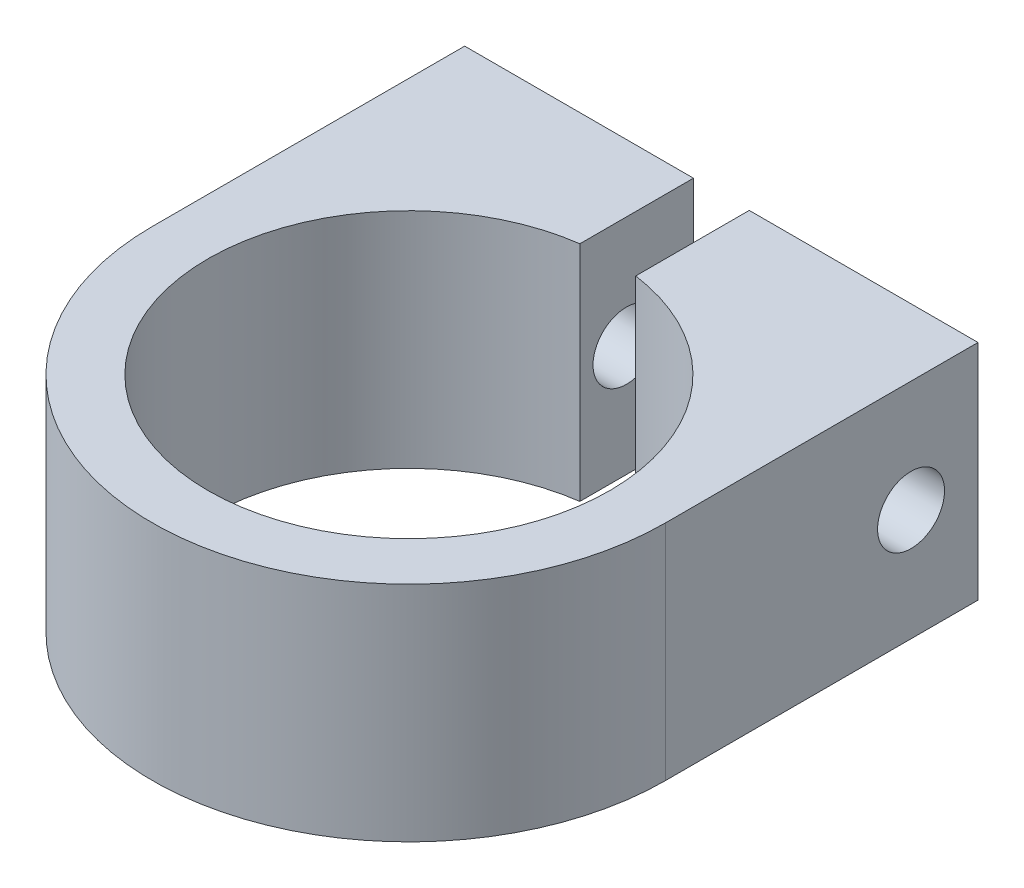
ISO-10303-21;
HEADER;
FILE_DESCRIPTION(('STEP AP214'),'2;1');
FILE_NAME('part.step','',(''),(''),'','','');
FILE_SCHEMA(('AUTOMOTIVE_DESIGN { 1 0 10303 214 1 1 1 1 }'));
ENDSEC;
DATA;
#1=APPLICATION_CONTEXT('core data for automotive mechanical design processes');
#2=APPLICATION_PROTOCOL_DEFINITION('international standard','automotive_design',2000,#1);
#3=PRODUCT_CONTEXT('',#1,'mechanical');
#4=PRODUCT('Part','Part','',(#3));
#5=PRODUCT_RELATED_PRODUCT_CATEGORY('part','',(#4));
#6=PRODUCT_DEFINITION_FORMATION('','',#4);
#7=PRODUCT_DEFINITION_CONTEXT('part definition',#1,'design');
#8=PRODUCT_DEFINITION('design','',#6,#7);
#9=PRODUCT_DEFINITION_SHAPE('','',#8);
#10=(LENGTH_UNIT() NAMED_UNIT(*) SI_UNIT(.MILLI.,.METRE.));
#11=(NAMED_UNIT(*) PLANE_ANGLE_UNIT() SI_UNIT($,.RADIAN.));
#12=(NAMED_UNIT(*) SI_UNIT($,.STERADIAN.) SOLID_ANGLE_UNIT());
#13=UNCERTAINTY_MEASURE_WITH_UNIT(LENGTH_MEASURE(1.E-05),#10,'distance_accuracy_value','');
#14=(GEOMETRIC_REPRESENTATION_CONTEXT(3) GLOBAL_UNCERTAINTY_ASSIGNED_CONTEXT((#13)) GLOBAL_UNIT_ASSIGNED_CONTEXT((#10,
#11,#12)) REPRESENTATION_CONTEXT('',''));
#15=CARTESIAN_POINT('',(0.,0.,0.));
#16=DIRECTION('',(0.,0.,1.));
#17=DIRECTION('',(1.,0.,0.));
#18=AXIS2_PLACEMENT_3D('',#15,#16,#17);
#19=CARTESIAN_POINT('',(-23.,9.99999999999993,-22.));
#20=DIRECTION('',(1.,0.,0.));
#21=DIRECTION('',(0.,0.,-1.));
#22=AXIS2_PLACEMENT_3D('',#19,#20,#21);
#23=CYLINDRICAL_SURFACE('',#22,3.);
#24=CARTESIAN_POINT('',(-2.5,9.99999999999993,-22.));
#25=DIRECTION('',(-1.,0.,0.));
#26=DIRECTION('',(0.,0.,1.));
#27=AXIS2_PLACEMENT_3D('',#24,#25,#26);
#28=CIRCLE('',#27,3.);
#29=CARTESIAN_POINT('',(-2.5,9.99999999999993,-19.));
#30=VERTEX_POINT('',#29);
#31=EDGE_CURVE('E195',#30,#30,#28,.T.);
#32=ORIENTED_EDGE('',*,*,#31,.F.);
#33=EDGE_LOOP('',(#32));
#34=FACE_BOUND('',#33,.T.);
#35=CARTESIAN_POINT('',(-13.,9.99999999999993,-22.));
#36=DIRECTION('',(-1.,0.,0.));
#37=DIRECTION('',(0.,0.,1.));
#38=AXIS2_PLACEMENT_3D('',#35,#36,#37);
#39=CIRCLE('',#38,3.);
#40=CARTESIAN_POINT('',(-13.,9.99999999999993,-19.));
#41=VERTEX_POINT('',#40);
#42=EDGE_CURVE('E37',#41,#41,#39,.F.);
#43=ORIENTED_EDGE('',*,*,#42,.F.);
#44=EDGE_LOOP('',(#43));
#45=FACE_BOUND('',#44,.T.);
#46=ADVANCED_FACE('F33',(#34,#45),#23,.F.);
#47=CARTESIAN_POINT('',(0.,20.,0.));
#48=DIRECTION('',(0.,-1.,0.));
#49=DIRECTION('',(0.,0.,-1.));
#50=AXIS2_PLACEMENT_3D('',#47,#48,#49);
#51=CYLINDRICAL_SURFACE('',#50,23.);
#52=CARTESIAN_POINT('',(0.,0.,0.));
#53=DIRECTION('',(0.,1.,0.));
#54=DIRECTION('',(0.,0.,1.));
#55=AXIS2_PLACEMENT_3D('',#52,#53,#54);
#56=CIRCLE('',#55,23.);
#57=CARTESIAN_POINT('',(-23.,0.,0.));
#58=VERTEX_POINT('',#57);
#59=CARTESIAN_POINT('',(23.,0.,0.));
#60=VERTEX_POINT('',#59);
#61=EDGE_CURVE('E143',#58,#60,#56,.T.);
#62=ORIENTED_EDGE('',*,*,#61,.T.);
#63=DIRECTION('',(0.,-1.,0.));
#64=VECTOR('',#63,1.);
#65=CARTESIAN_POINT('',(23.,20.,0.));
#66=LINE('',#65,#64);
#67=CARTESIAN_POINT('',(23.,20.,0.));
#68=VERTEX_POINT('',#67);
#69=EDGE_CURVE('E11',#68,#60,#66,.T.);
#70=ORIENTED_EDGE('',*,*,#69,.F.);
#71=CARTESIAN_POINT('',(0.,20.,0.));
#72=DIRECTION('',(0.,1.,0.));
#73=DIRECTION('',(0.,0.,1.));
#74=AXIS2_PLACEMENT_3D('',#71,#72,#73);
#75=CIRCLE('',#74,23.);
#76=CARTESIAN_POINT('',(-23.,20.,0.));
#77=VERTEX_POINT('',#76);
#78=EDGE_CURVE('E159',#77,#68,#75,.T.);
#79=ORIENTED_EDGE('',*,*,#78,.F.);
#80=DIRECTION('',(0.,-1.,0.));
#81=VECTOR('',#80,1.);
#82=CARTESIAN_POINT('',(-23.,20.,0.));
#83=LINE('',#82,#81);
#84=EDGE_CURVE('E139',#77,#58,#83,.T.);
#85=ORIENTED_EDGE('',*,*,#84,.T.);
#86=EDGE_LOOP('',(#62,#70,#79,#85));
#87=FACE_BOUND('',#86,.T.);
#88=ADVANCED_FACE('F35',(#87),#51,.T.);
#89=CARTESIAN_POINT('',(23.,20.,0.));
#90=DIRECTION('',(-1.,0.,0.));
#91=DIRECTION('',(0.,0.,1.));
#92=AXIS2_PLACEMENT_3D('',#89,#90,#91);
#93=PLANE('',#92);
#94=CARTESIAN_POINT('',(23.,9.99999999999993,-22.));
#95=DIRECTION('',(1.,0.,0.));
#96=DIRECTION('',(0.,0.,-1.));
#97=AXIS2_PLACEMENT_3D('',#94,#95,#96);
#98=CIRCLE('',#97,3.);
#99=CARTESIAN_POINT('',(23.,9.99999999999993,-25.));
#100=VERTEX_POINT('',#99);
#101=EDGE_CURVE('E198',#100,#100,#98,.T.);
#102=ORIENTED_EDGE('',*,*,#101,.F.);
#103=EDGE_LOOP('',(#102));
#104=FACE_BOUND('',#103,.T.);
#105=DIRECTION('',(0.,0.,-1.));
#106=VECTOR('',#105,1.);
#107=CARTESIAN_POINT('',(23.,0.,0.));
#108=LINE('',#107,#106);
#109=CARTESIAN_POINT('',(23.,0.,-28.));
#110=VERTEX_POINT('',#109);
#111=EDGE_CURVE('E146',#60,#110,#108,.T.);
#112=ORIENTED_EDGE('',*,*,#111,.T.);
#113=DIRECTION('',(0.,-1.,0.));
#114=VECTOR('',#113,1.);
#115=CARTESIAN_POINT('',(23.,20.,-28.));
#116=LINE('',#115,#114);
#117=CARTESIAN_POINT('',(23.,20.,-28.));
#118=VERTEX_POINT('',#117);
#119=EDGE_CURVE('E42',#118,#110,#116,.T.);
#120=ORIENTED_EDGE('',*,*,#119,.F.);
#121=DIRECTION('',(0.,0.,-1.));
#122=VECTOR('',#121,1.);
#123=CARTESIAN_POINT('',(23.,20.,0.));
#124=LINE('',#123,#122);
#125=EDGE_CURVE('E99',#68,#118,#124,.T.);
#126=ORIENTED_EDGE('',*,*,#125,.F.);
#127=ORIENTED_EDGE('',*,*,#69,.T.);
#128=EDGE_LOOP('',(#112,#120,#126,#127));
#129=FACE_BOUND('',#128,.T.);
#130=ADVANCED_FACE('F315',(#104,#129),#93,.F.);
#131=CARTESIAN_POINT('',(23.,20.,-28.));
#132=DIRECTION('',(0.,0.,1.));
#133=DIRECTION('',(1.,0.,0.));
#134=AXIS2_PLACEMENT_3D('',#131,#132,#133);
#135=PLANE('',#134);
#136=DIRECTION('',(-1.,0.,0.));
#137=VECTOR('',#136,1.);
#138=CARTESIAN_POINT('',(23.,0.,-28.));
#139=LINE('',#138,#137);
#140=CARTESIAN_POINT('',(2.5,0.,-28.));
#141=VERTEX_POINT('',#140);
#142=EDGE_CURVE('E149',#110,#141,#139,.T.);
#143=ORIENTED_EDGE('',*,*,#142,.T.);
#144=DIRECTION('',(0.,-1.,0.));
#145=VECTOR('',#144,1.);
#146=CARTESIAN_POINT('',(2.5,20.,-28.));
#147=LINE('',#146,#145);
#148=CARTESIAN_POINT('',(2.5,20.,-28.));
#149=VERTEX_POINT('',#148);
#150=EDGE_CURVE('E166',#149,#141,#147,.T.);
#151=ORIENTED_EDGE('',*,*,#150,.F.);
#152=DIRECTION('',(-1.,0.,0.));
#153=VECTOR('',#152,1.);
#154=CARTESIAN_POINT('',(23.,20.,-28.));
#155=LINE('',#154,#153);
#156=EDGE_CURVE('E175',#118,#149,#155,.T.);
#157=ORIENTED_EDGE('',*,*,#156,.F.);
#158=ORIENTED_EDGE('',*,*,#119,.T.);
#159=EDGE_LOOP('',(#143,#151,#157,#158));
#160=FACE_BOUND('',#159,.T.);
#161=ADVANCED_FACE('F173',(#160),#135,.F.);
#162=CARTESIAN_POINT('',(2.5,20.,-28.));
#163=DIRECTION('',(1.,0.,0.));
#164=DIRECTION('',(0.,0.,-1.));
#165=AXIS2_PLACEMENT_3D('',#162,#163,#164);
#166=PLANE('',#165);
#167=CARTESIAN_POINT('',(2.5,9.99999999999993,-22.));
#168=DIRECTION('',(1.,0.,0.));
#169=DIRECTION('',(0.,0.,-1.));
#170=AXIS2_PLACEMENT_3D('',#167,#168,#169);
#171=CIRCLE('',#170,3.);
#172=CARTESIAN_POINT('',(2.5,9.99999999999993,-25.));
#173=VERTEX_POINT('',#172);
#174=EDGE_CURVE('E147',#173,#173,#171,.T.);
#175=ORIENTED_EDGE('',*,*,#174,.T.);
#176=EDGE_LOOP('',(#175));
#177=FACE_BOUND('',#176,.T.);
#178=DIRECTION('',(0.,0.,1.));
#179=VECTOR('',#178,1.);
#180=CARTESIAN_POINT('',(2.5,0.,-28.));
#181=LINE('',#180,#179);
#182=CARTESIAN_POINT('',(2.50000000000001,0.,-17.8255434699759));
#183=VERTEX_POINT('',#182);
#184=EDGE_CURVE('E151',#141,#183,#181,.T.);
#185=ORIENTED_EDGE('',*,*,#184,.T.);
#186=DIRECTION('',(0.,-1.,0.));
#187=VECTOR('',#186,1.);
#188=CARTESIAN_POINT('',(2.50000000000001,20.,-17.8255434699759));
#189=LINE('',#188,#187);
#190=CARTESIAN_POINT('',(2.50000000000001,20.,-17.8255434699759));
#191=VERTEX_POINT('',#190);
#192=EDGE_CURVE('E163',#191,#183,#189,.T.);
#193=ORIENTED_EDGE('',*,*,#192,.F.);
#194=DIRECTION('',(0.,0.,1.));
#195=VECTOR('',#194,1.);
#196=CARTESIAN_POINT('',(2.5,20.,-28.));
#197=LINE('',#196,#195);
#198=EDGE_CURVE('E187',#149,#191,#197,.T.);
#199=ORIENTED_EDGE('',*,*,#198,.F.);
#200=ORIENTED_EDGE('',*,*,#150,.T.);
#201=EDGE_LOOP('',(#185,#193,#199,#200));
#202=FACE_BOUND('',#201,.T.);
#203=ADVANCED_FACE('F183',(#177,#202),#166,.F.);
#204=CARTESIAN_POINT('',(0.,20.,0.));
#205=DIRECTION('',(0.,-1.,0.));
#206=DIRECTION('',(0.,0.,-1.));
#207=AXIS2_PLACEMENT_3D('',#204,#205,#206);
#208=CYLINDRICAL_SURFACE('',#207,18.);
#209=CARTESIAN_POINT('',(0.,0.,0.));
#210=DIRECTION('',(0.,-1.,0.));
#211=DIRECTION('',(0.,0.,1.));
#212=AXIS2_PLACEMENT_3D('',#209,#210,#211);
#213=CIRCLE('',#212,18.);
#214=CARTESIAN_POINT('',(-2.5,0.,-17.8255434699759));
#215=VERTEX_POINT('',#214);
#216=EDGE_CURVE('E153',#183,#215,#213,.T.);
#217=ORIENTED_EDGE('',*,*,#216,.T.);
#218=DIRECTION('',(0.,-1.,0.));
#219=VECTOR('',#218,1.);
#220=CARTESIAN_POINT('',(-2.5,20.,-17.8255434699759));
#221=LINE('',#220,#219);
#222=CARTESIAN_POINT('',(-2.5,20.,-17.8255434699759));
#223=VERTEX_POINT('',#222);
#224=EDGE_CURVE('E134',#223,#215,#221,.T.);
#225=ORIENTED_EDGE('',*,*,#224,.F.);
#226=CARTESIAN_POINT('',(0.,20.,0.));
#227=DIRECTION('',(0.,-1.,0.));
#228=DIRECTION('',(0.,0.,1.));
#229=AXIS2_PLACEMENT_3D('',#226,#227,#228);
#230=CIRCLE('',#229,18.);
#231=EDGE_CURVE('E122',#191,#223,#230,.T.);
#232=ORIENTED_EDGE('',*,*,#231,.F.);
#233=ORIENTED_EDGE('',*,*,#192,.T.);
#234=EDGE_LOOP('',(#217,#225,#232,#233));
#235=FACE_BOUND('',#234,.T.);
#236=ADVANCED_FACE('F186',(#235),#208,.F.);
#237=CARTESIAN_POINT('',(-2.5,20.,-28.));
#238=DIRECTION('',(-1.,0.,0.));
#239=DIRECTION('',(0.,0.,1.));
#240=AXIS2_PLACEMENT_3D('',#237,#238,#239);
#241=PLANE('',#240);
#242=ORIENTED_EDGE('',*,*,#31,.T.);
#243=EDGE_LOOP('',(#242));
#244=FACE_BOUND('',#243,.T.);
#245=DIRECTION('',(0.,0.,-1.));
#246=VECTOR('',#245,1.);
#247=CARTESIAN_POINT('',(-2.5,0.,-28.));
#248=LINE('',#247,#246);
#249=CARTESIAN_POINT('',(-2.5,0.,-28.));
#250=VERTEX_POINT('',#249);
#251=EDGE_CURVE('E131',#215,#250,#248,.T.);
#252=ORIENTED_EDGE('',*,*,#251,.T.);
#253=DIRECTION('',(0.,-1.,0.));
#254=VECTOR('',#253,1.);
#255=CARTESIAN_POINT('',(-2.5,20.,-28.));
#256=LINE('',#255,#254);
#257=CARTESIAN_POINT('',(-2.5,20.,-28.));
#258=VERTEX_POINT('',#257);
#259=EDGE_CURVE('E128',#258,#250,#256,.T.);
#260=ORIENTED_EDGE('',*,*,#259,.F.);
#261=DIRECTION('',(0.,0.,-1.));
#262=VECTOR('',#261,1.);
#263=CARTESIAN_POINT('',(-2.5,20.,-28.));
#264=LINE('',#263,#262);
#265=EDGE_CURVE('E115',#223,#258,#264,.T.);
#266=ORIENTED_EDGE('',*,*,#265,.F.);
#267=ORIENTED_EDGE('',*,*,#224,.T.);
#268=EDGE_LOOP('',(#252,#260,#266,#267));
#269=FACE_BOUND('',#268,.T.);
#270=ADVANCED_FACE('F129',(#244,#269),#241,.F.);
#271=CARTESIAN_POINT('',(-23.,20.,-28.));
#272=DIRECTION('',(0.,0.,1.));
#273=DIRECTION('',(1.,0.,0.));
#274=AXIS2_PLACEMENT_3D('',#271,#272,#273);
#275=PLANE('',#274);
#276=DIRECTION('',(-1.,0.,0.));
#277=VECTOR('',#276,1.);
#278=CARTESIAN_POINT('',(-23.,0.,-28.));
#279=LINE('',#278,#277);
#280=CARTESIAN_POINT('',(-23.,0.,-28.));
#281=VERTEX_POINT('',#280);
#282=EDGE_CURVE('E156',#250,#281,#279,.T.);
#283=ORIENTED_EDGE('',*,*,#282,.T.);
#284=DIRECTION('',(0.,-1.,0.));
#285=VECTOR('',#284,1.);
#286=CARTESIAN_POINT('',(-23.,20.,-28.));
#287=LINE('',#286,#285);
#288=CARTESIAN_POINT('',(-23.,20.,-28.));
#289=VERTEX_POINT('',#288);
#290=EDGE_CURVE('E135',#289,#281,#287,.T.);
#291=ORIENTED_EDGE('',*,*,#290,.F.);
#292=DIRECTION('',(-1.,0.,0.));
#293=VECTOR('',#292,1.);
#294=CARTESIAN_POINT('',(-23.,20.,-28.));
#295=LINE('',#294,#293);
#296=EDGE_CURVE('E119',#258,#289,#295,.T.);
#297=ORIENTED_EDGE('',*,*,#296,.F.);
#298=ORIENTED_EDGE('',*,*,#259,.T.);
#299=EDGE_LOOP('',(#283,#291,#297,#298));
#300=FACE_BOUND('',#299,.T.);
#301=ADVANCED_FACE('F137',(#300),#275,.F.);
#302=CARTESIAN_POINT('',(-23.,20.,0.));
#303=DIRECTION('',(1.,0.,0.));
#304=DIRECTION('',(0.,0.,-1.));
#305=AXIS2_PLACEMENT_3D('',#302,#303,#304);
#306=PLANE('',#305);
#307=DIRECTION('',(0.,0.5,0.866025403784439));
#308=VECTOR('',#307,1.);
#309=CARTESIAN_POINT('',(-23.,4.2264973081038,-22.));
#310=LINE('',#309,#308);
#311=CARTESIAN_POINT('',(-23.,4.2264973081038,-22.));
#312=VERTEX_POINT('',#311);
#313=CARTESIAN_POINT('',(-23.,7.11324865405193,-17.));
#314=VERTEX_POINT('',#313);
#315=EDGE_CURVE('E231',#312,#314,#310,.T.);
#316=ORIENTED_EDGE('',*,*,#315,.F.);
#317=DIRECTION('',(0.,-0.5,0.866025403784439));
#318=VECTOR('',#317,1.);
#319=CARTESIAN_POINT('',(-23.,7.11324865405193,-27.));
#320=LINE('',#319,#318);
#321=CARTESIAN_POINT('',(-23.,7.11324865405193,-27.));
#322=VERTEX_POINT('',#321);
#323=EDGE_CURVE('E49',#322,#312,#320,.T.);
#324=ORIENTED_EDGE('',*,*,#323,.F.);
#325=DIRECTION('',(0.,-1.,0.));
#326=VECTOR('',#325,1.);
#327=CARTESIAN_POINT('',(-23.,12.8867513459482,-27.));
#328=LINE('',#327,#326);
#329=CARTESIAN_POINT('',(-23.,12.8867513459482,-27.));
#330=VERTEX_POINT('',#329);
#331=EDGE_CURVE('E218',#330,#322,#328,.T.);
#332=ORIENTED_EDGE('',*,*,#331,.F.);
#333=DIRECTION('',(0.,-0.5,-0.866025403784439));
#334=VECTOR('',#333,1.);
#335=CARTESIAN_POINT('',(-23.,15.7735026918963,-22.));
#336=LINE('',#335,#334);
#337=CARTESIAN_POINT('',(-23.,15.7735026918963,-22.));
#338=VERTEX_POINT('',#337);
#339=EDGE_CURVE('E222',#338,#330,#336,.T.);
#340=ORIENTED_EDGE('',*,*,#339,.F.);
#341=DIRECTION('',(0.,0.5,-0.866025403784439));
#342=VECTOR('',#341,1.);
#343=CARTESIAN_POINT('',(-23.,12.8867513459482,-17.));
#344=LINE('',#343,#342);
#345=CARTESIAN_POINT('',(-23.,12.8867513459482,-17.));
#346=VERTEX_POINT('',#345);
#347=EDGE_CURVE('E225',#346,#338,#344,.T.);
#348=ORIENTED_EDGE('',*,*,#347,.F.);
#349=DIRECTION('',(0.,1.,0.));
#350=VECTOR('',#349,1.);
#351=CARTESIAN_POINT('',(-23.,7.11324865405193,-17.));
#352=LINE('',#351,#350);
#353=EDGE_CURVE('E228',#314,#346,#352,.T.);
#354=ORIENTED_EDGE('',*,*,#353,.F.);
#355=EDGE_LOOP('',(#316,#324,#332,#340,#348,#354));
#356=FACE_BOUND('',#355,.T.);
#357=DIRECTION('',(0.,0.,1.));
#358=VECTOR('',#357,1.);
#359=CARTESIAN_POINT('',(-23.,0.,0.));
#360=LINE('',#359,#358);
#361=EDGE_CURVE('E91',#281,#58,#360,.T.);
#362=ORIENTED_EDGE('',*,*,#361,.T.);
#363=ORIENTED_EDGE('',*,*,#84,.F.);
#364=DIRECTION('',(0.,0.,1.));
#365=VECTOR('',#364,1.);
#366=CARTESIAN_POINT('',(-23.,20.,0.));
#367=LINE('',#366,#365);
#368=EDGE_CURVE('E58',#289,#77,#367,.T.);
#369=ORIENTED_EDGE('',*,*,#368,.F.);
#370=ORIENTED_EDGE('',*,*,#290,.T.);
#371=EDGE_LOOP('',(#362,#363,#369,#370));
#372=FACE_BOUND('',#371,.T.);
#373=ADVANCED_FACE('F285',(#356,#372),#306,.F.);
#374=CARTESIAN_POINT('',(0.,20.,0.));
#375=DIRECTION('',(0.,1.,0.));
#376=DIRECTION('',(0.,0.,1.));
#377=AXIS2_PLACEMENT_3D('',#374,#375,#376);
#378=PLANE('',#377);
#379=ORIENTED_EDGE('',*,*,#78,.T.);
#380=ORIENTED_EDGE('',*,*,#125,.T.);
#381=ORIENTED_EDGE('',*,*,#156,.T.);
#382=ORIENTED_EDGE('',*,*,#198,.T.);
#383=ORIENTED_EDGE('',*,*,#231,.T.);
#384=ORIENTED_EDGE('',*,*,#265,.T.);
#385=ORIENTED_EDGE('',*,*,#296,.T.);
#386=ORIENTED_EDGE('',*,*,#368,.T.);
#387=EDGE_LOOP('',(#379,#380,#381,#382,#383,#384,#385,#386));
#388=FACE_BOUND('',#387,.T.);
#389=ADVANCED_FACE('F117',(#388),#378,.T.);
#390=CARTESIAN_POINT('',(0.,0.,0.));
#391=DIRECTION('',(0.,1.,0.));
#392=DIRECTION('',(0.,0.,1.));
#393=AXIS2_PLACEMENT_3D('',#390,#391,#392);
#394=PLANE('',#393);
#395=ORIENTED_EDGE('',*,*,#61,.F.);
#396=ORIENTED_EDGE('',*,*,#361,.F.);
#397=ORIENTED_EDGE('',*,*,#282,.F.);
#398=ORIENTED_EDGE('',*,*,#251,.F.);
#399=ORIENTED_EDGE('',*,*,#216,.F.);
#400=ORIENTED_EDGE('',*,*,#184,.F.);
#401=ORIENTED_EDGE('',*,*,#142,.F.);
#402=ORIENTED_EDGE('',*,*,#111,.F.);
#403=EDGE_LOOP('',(#395,#396,#397,#398,#399,#400,#401,#402));
#404=FACE_BOUND('',#403,.T.);
#405=ADVANCED_FACE('F179',(#404),#394,.F.);
#406=ORIENTED_EDGE('',*,*,#101,.T.);
#407=EDGE_LOOP('',(#406));
#408=FACE_BOUND('',#407,.T.);
#409=ORIENTED_EDGE('',*,*,#174,.F.);
#410=EDGE_LOOP('',(#409));
#411=FACE_BOUND('',#410,.T.);
#412=ADVANCED_FACE('F311',(#408,#411),#23,.F.);
#413=CARTESIAN_POINT('',(-13.,0.,0.));
#414=DIRECTION('',(-1.,0.,0.));
#415=DIRECTION('',(0.,0.,1.));
#416=AXIS2_PLACEMENT_3D('',#413,#414,#415);
#417=PLANE('',#416);
#418=DIRECTION('',(0.,-0.5,0.866025403784439));
#419=VECTOR('',#418,1.);
#420=CARTESIAN_POINT('',(-13.,7.11324865405193,-27.));
#421=LINE('',#420,#419);
#422=CARTESIAN_POINT('',(-13.,7.11324865405193,-27.));
#423=VERTEX_POINT('',#422);
#424=CARTESIAN_POINT('',(-13.,4.2264973081038,-22.));
#425=VERTEX_POINT('',#424);
#426=EDGE_CURVE('E221',#423,#425,#421,.T.);
#427=ORIENTED_EDGE('',*,*,#426,.T.);
#428=DIRECTION('',(0.,0.5,0.866025403784439));
#429=VECTOR('',#428,1.);
#430=CARTESIAN_POINT('',(-13.,4.2264973081038,-22.));
#431=LINE('',#430,#429);
#432=CARTESIAN_POINT('',(-13.,7.11324865405193,-17.));
#433=VERTEX_POINT('',#432);
#434=EDGE_CURVE('E246',#425,#433,#431,.T.);
#435=ORIENTED_EDGE('',*,*,#434,.T.);
#436=DIRECTION('',(0.,1.,0.));
#437=VECTOR('',#436,1.);
#438=CARTESIAN_POINT('',(-13.,7.11324865405193,-17.));
#439=LINE('',#438,#437);
#440=CARTESIAN_POINT('',(-13.,12.8867513459482,-17.));
#441=VERTEX_POINT('',#440);
#442=EDGE_CURVE('E243',#433,#441,#439,.T.);
#443=ORIENTED_EDGE('',*,*,#442,.T.);
#444=DIRECTION('',(0.,0.5,-0.866025403784439));
#445=VECTOR('',#444,1.);
#446=CARTESIAN_POINT('',(-13.,12.8867513459482,-17.));
#447=LINE('',#446,#445);
#448=CARTESIAN_POINT('',(-13.,15.7735026918963,-22.));
#449=VERTEX_POINT('',#448);
#450=EDGE_CURVE('E240',#441,#449,#447,.T.);
#451=ORIENTED_EDGE('',*,*,#450,.T.);
#452=DIRECTION('',(0.,-0.5,-0.866025403784439));
#453=VECTOR('',#452,1.);
#454=CARTESIAN_POINT('',(-13.,15.7735026918963,-22.));
#455=LINE('',#454,#453);
#456=CARTESIAN_POINT('',(-13.,12.8867513459482,-27.));
#457=VERTEX_POINT('',#456);
#458=EDGE_CURVE('E237',#449,#457,#455,.T.);
#459=ORIENTED_EDGE('',*,*,#458,.T.);
#460=DIRECTION('',(0.,-1.,0.));
#461=VECTOR('',#460,1.);
#462=CARTESIAN_POINT('',(-13.,12.8867513459482,-27.));
#463=LINE('',#462,#461);
#464=EDGE_CURVE('E204',#457,#423,#463,.T.);
#465=ORIENTED_EDGE('',*,*,#464,.T.);
#466=EDGE_LOOP('',(#427,#435,#443,#451,#459,#465));
#467=FACE_BOUND('',#466,.T.);
#468=ORIENTED_EDGE('',*,*,#42,.T.);
#469=EDGE_LOOP('',(#468));
#470=FACE_BOUND('',#469,.T.);
#471=ADVANCED_FACE('F253',(#467,#470),#417,.T.);
#472=CARTESIAN_POINT('',(-13.,7.11324865405193,-27.));
#473=DIRECTION('',(0.,-0.866025403784438,-0.5));
#474=DIRECTION('',(0.,0.5,-0.866025403784439));
#475=AXIS2_PLACEMENT_3D('',#472,#473,#474);
#476=PLANE('',#475);
#477=ORIENTED_EDGE('',*,*,#323,.T.);
#478=DIRECTION('',(-1.,0.,0.));
#479=VECTOR('',#478,1.);
#480=CARTESIAN_POINT('',(-13.,4.2264973081038,-22.));
#481=LINE('',#480,#479);
#482=EDGE_CURVE('E201',#425,#312,#481,.T.);
#483=ORIENTED_EDGE('',*,*,#482,.F.);
#484=ORIENTED_EDGE('',*,*,#426,.F.);
#485=DIRECTION('',(-1.,0.,0.));
#486=VECTOR('',#485,1.);
#487=CARTESIAN_POINT('',(-13.,7.11324865405193,-27.));
#488=LINE('',#487,#486);
#489=EDGE_CURVE('E216',#423,#322,#488,.T.);
#490=ORIENTED_EDGE('',*,*,#489,.T.);
#491=EDGE_LOOP('',(#477,#483,#484,#490));
#492=FACE_BOUND('',#491,.T.);
#493=ADVANCED_FACE('F259',(#492),#476,.F.);
#494=CARTESIAN_POINT('',(-13.,12.8867513459482,-27.));
#495=DIRECTION('',(0.,0.,-1.));
#496=DIRECTION('',(-1.,0.,0.));
#497=AXIS2_PLACEMENT_3D('',#494,#495,#496);
#498=PLANE('',#497);
#499=ORIENTED_EDGE('',*,*,#331,.T.);
#500=ORIENTED_EDGE('',*,*,#489,.F.);
#501=ORIENTED_EDGE('',*,*,#464,.F.);
#502=DIRECTION('',(-1.,0.,0.));
#503=VECTOR('',#502,1.);
#504=CARTESIAN_POINT('',(-13.,12.8867513459482,-27.));
#505=LINE('',#504,#503);
#506=EDGE_CURVE('E213',#457,#330,#505,.T.);
#507=ORIENTED_EDGE('',*,*,#506,.T.);
#508=EDGE_LOOP('',(#499,#500,#501,#507));
#509=FACE_BOUND('',#508,.T.);
#510=ADVANCED_FACE('F275',(#509),#498,.F.);
#511=CARTESIAN_POINT('',(-13.,15.7735026918963,-22.));
#512=DIRECTION('',(0.,0.866025403784439,-0.5));
#513=DIRECTION('',(0.,0.5,0.866025403784439));
#514=AXIS2_PLACEMENT_3D('',#511,#512,#513);
#515=PLANE('',#514);
#516=ORIENTED_EDGE('',*,*,#339,.T.);
#517=ORIENTED_EDGE('',*,*,#506,.F.);
#518=ORIENTED_EDGE('',*,*,#458,.F.);
#519=DIRECTION('',(-1.,0.,0.));
#520=VECTOR('',#519,1.);
#521=CARTESIAN_POINT('',(-13.,15.7735026918963,-22.));
#522=LINE('',#521,#520);
#523=EDGE_CURVE('E210',#449,#338,#522,.T.);
#524=ORIENTED_EDGE('',*,*,#523,.T.);
#525=EDGE_LOOP('',(#516,#517,#518,#524));
#526=FACE_BOUND('',#525,.T.);
#527=ADVANCED_FACE('F280',(#526),#515,.F.);
#528=CARTESIAN_POINT('',(-13.,12.8867513459482,-17.));
#529=DIRECTION('',(0.,0.866025403784439,0.5));
#530=DIRECTION('',(0.,-0.5,0.866025403784439));
#531=AXIS2_PLACEMENT_3D('',#528,#529,#530);
#532=PLANE('',#531);
#533=ORIENTED_EDGE('',*,*,#347,.T.);
#534=ORIENTED_EDGE('',*,*,#523,.F.);
#535=ORIENTED_EDGE('',*,*,#450,.F.);
#536=DIRECTION('',(-1.,0.,0.));
#537=VECTOR('',#536,1.);
#538=CARTESIAN_POINT('',(-13.,12.8867513459482,-17.));
#539=LINE('',#538,#537);
#540=EDGE_CURVE('E207',#441,#346,#539,.T.);
#541=ORIENTED_EDGE('',*,*,#540,.T.);
#542=EDGE_LOOP('',(#533,#534,#535,#541));
#543=FACE_BOUND('',#542,.T.);
#544=ADVANCED_FACE('F299',(#543),#532,.F.);
#545=CARTESIAN_POINT('',(-13.,7.11324865405193,-17.));
#546=DIRECTION('',(0.,0.,1.));
#547=DIRECTION('',(1.,0.,0.));
#548=AXIS2_PLACEMENT_3D('',#545,#546,#547);
#549=PLANE('',#548);
#550=ORIENTED_EDGE('',*,*,#353,.T.);
#551=ORIENTED_EDGE('',*,*,#540,.F.);
#552=ORIENTED_EDGE('',*,*,#442,.F.);
#553=DIRECTION('',(-1.,0.,0.));
#554=VECTOR('',#553,1.);
#555=CARTESIAN_POINT('',(-13.,7.11324865405193,-17.));
#556=LINE('',#555,#554);
#557=EDGE_CURVE('E203',#433,#314,#556,.T.);
#558=ORIENTED_EDGE('',*,*,#557,.T.);
#559=EDGE_LOOP('',(#550,#551,#552,#558));
#560=FACE_BOUND('',#559,.T.);
#561=ADVANCED_FACE('F295',(#560),#549,.F.);
#562=CARTESIAN_POINT('',(-13.,4.2264973081038,-22.));
#563=DIRECTION('',(0.,-0.866025403784439,0.5));
#564=DIRECTION('',(0.,-0.5,-0.866025403784439));
#565=AXIS2_PLACEMENT_3D('',#562,#563,#564);
#566=PLANE('',#565);
#567=ORIENTED_EDGE('',*,*,#315,.T.);
#568=ORIENTED_EDGE('',*,*,#557,.F.);
#569=ORIENTED_EDGE('',*,*,#434,.F.);
#570=ORIENTED_EDGE('',*,*,#482,.T.);
#571=EDGE_LOOP('',(#567,#568,#569,#570));
#572=FACE_BOUND('',#571,.T.);
#573=ADVANCED_FACE('F289',(#572),#566,.F.);
#574=CLOSED_SHELL('',(#46,#88,#130,#161,#203,#236,#270,#301,#373,#389,#405,#412,#471,#493,#510,
#527,#544,#561,#573));
#575=MANIFOLD_SOLID_BREP('B2',#574);
#576=ADVANCED_BREP_SHAPE_REPRESENTATION('',(#18,#575),#14);
#577=SHAPE_DEFINITION_REPRESENTATION(#9,#576);
ENDSEC;
END-ISO-10303-21;
